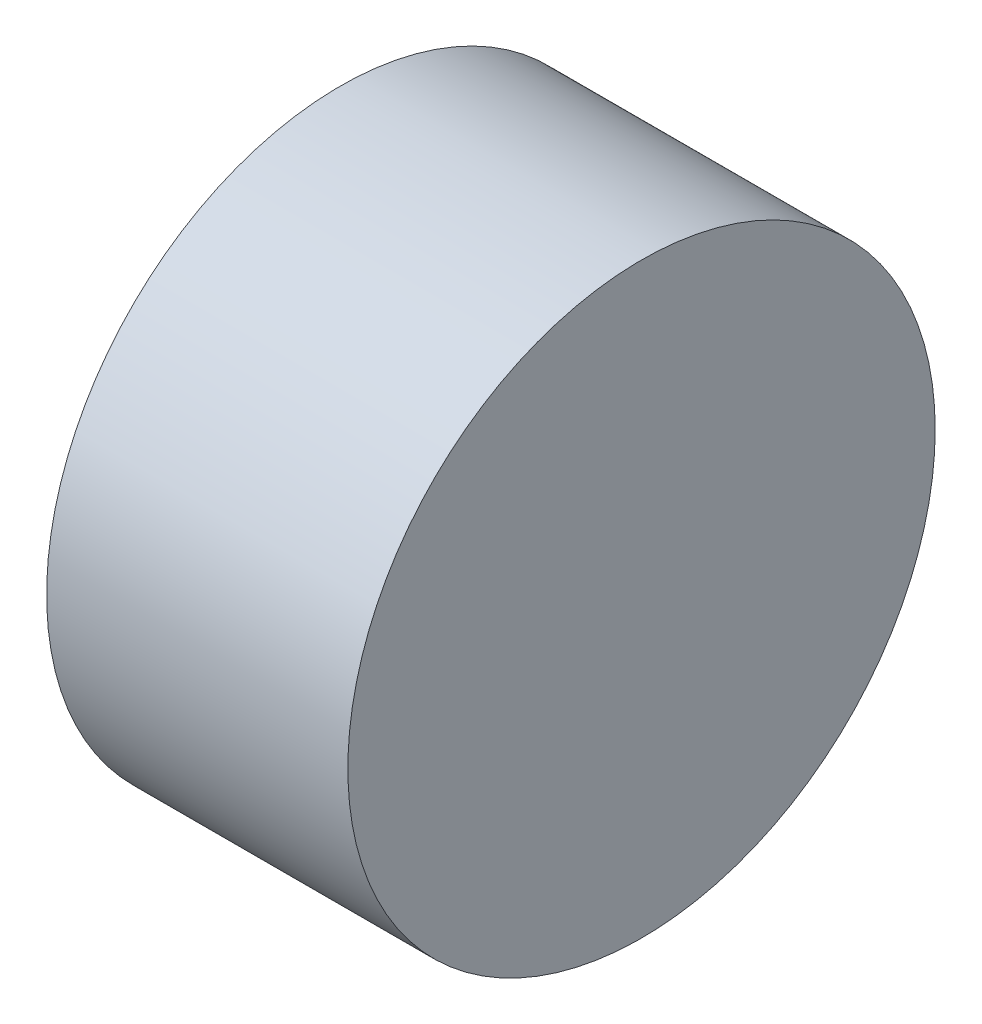
ISO-10303-21;
HEADER;
FILE_DESCRIPTION(('STEP AP214'),'2;1');
FILE_NAME('part.step','',(''),(''),'','','');
FILE_SCHEMA(('AUTOMOTIVE_DESIGN { 1 0 10303 214 1 1 1 1 }'));
ENDSEC;
DATA;
#1=APPLICATION_CONTEXT('core data for automotive mechanical design processes');
#2=APPLICATION_PROTOCOL_DEFINITION('international standard','automotive_design',2000,#1);
#3=PRODUCT_CONTEXT('',#1,'mechanical');
#4=PRODUCT('Part','Part','',(#3));
#5=PRODUCT_RELATED_PRODUCT_CATEGORY('part','',(#4));
#6=PRODUCT_DEFINITION_FORMATION('','',#4);
#7=PRODUCT_DEFINITION_CONTEXT('part definition',#1,'design');
#8=PRODUCT_DEFINITION('design','',#6,#7);
#9=PRODUCT_DEFINITION_SHAPE('','',#8);
#10=(LENGTH_UNIT() NAMED_UNIT(*) SI_UNIT(.MILLI.,.METRE.));
#11=(NAMED_UNIT(*) PLANE_ANGLE_UNIT() SI_UNIT($,.RADIAN.));
#12=(NAMED_UNIT(*) SI_UNIT($,.STERADIAN.) SOLID_ANGLE_UNIT());
#13=UNCERTAINTY_MEASURE_WITH_UNIT(LENGTH_MEASURE(1.E-05),#10,'distance_accuracy_value','');
#14=(GEOMETRIC_REPRESENTATION_CONTEXT(3) GLOBAL_UNCERTAINTY_ASSIGNED_CONTEXT((#13)) GLOBAL_UNIT_ASSIGNED_CONTEXT((#10,
#11,#12)) REPRESENTATION_CONTEXT('',''));
#15=CARTESIAN_POINT('',(0.,0.,0.));
#16=DIRECTION('',(0.,0.,1.));
#17=DIRECTION('',(1.,0.,0.));
#18=AXIS2_PLACEMENT_3D('',#15,#16,#17);
#19=CARTESIAN_POINT('',(8.,0.,0.));
#20=DIRECTION('',(-1.,0.,0.));
#21=DIRECTION('',(0.,0.,1.));
#22=AXIS2_PLACEMENT_3D('',#19,#20,#21);
#23=CYLINDRICAL_SURFACE('',#22,7.8);
#24=CARTESIAN_POINT('',(8.,0.,0.));
#25=DIRECTION('',(1.,0.,0.));
#26=DIRECTION('',(0.,0.,-1.));
#27=AXIS2_PLACEMENT_3D('',#24,#25,#26);
#28=CIRCLE('',#27,7.8);
#29=CARTESIAN_POINT('',(8.,0.,-7.8));
#30=VERTEX_POINT('',#29);
#31=EDGE_CURVE('E10',#30,#30,#28,.T.);
#32=ORIENTED_EDGE('',*,*,#31,.F.);
#33=EDGE_LOOP('',(#32));
#34=FACE_BOUND('',#33,.T.);
#35=CARTESIAN_POINT('',(0.,0.,0.));
#36=DIRECTION('',(1.,0.,0.));
#37=DIRECTION('',(0.,0.,-1.));
#38=AXIS2_PLACEMENT_3D('',#35,#36,#37);
#39=CIRCLE('',#38,7.8);
#40=CARTESIAN_POINT('',(0.,0.,-7.8));
#41=VERTEX_POINT('',#40);
#42=EDGE_CURVE('E36',#41,#41,#39,.T.);
#43=ORIENTED_EDGE('',*,*,#42,.T.);
#44=EDGE_LOOP('',(#43));
#45=FACE_BOUND('',#44,.T.);
#46=ADVANCED_FACE('F33',(#34,#45),#23,.T.);
#47=CARTESIAN_POINT('',(8.,0.,0.));
#48=DIRECTION('',(1.,0.,0.));
#49=DIRECTION('',(0.,0.,-1.));
#50=AXIS2_PLACEMENT_3D('',#47,#48,#49);
#51=PLANE('',#50);
#52=ORIENTED_EDGE('',*,*,#31,.T.);
#53=EDGE_LOOP('',(#52));
#54=FACE_BOUND('',#53,.T.);
#55=ADVANCED_FACE('F62',(#54),#51,.T.);
#56=CARTESIAN_POINT('',(0.,0.,0.));
#57=DIRECTION('',(1.,0.,0.));
#58=DIRECTION('',(0.,0.,-1.));
#59=AXIS2_PLACEMENT_3D('',#56,#57,#58);
#60=PLANE('',#59);
#61=CARTESIAN_POINT('',(0.,0.,0.));
#62=DIRECTION('',(-1.,0.,0.));
#63=DIRECTION('',(0.,0.,1.));
#64=AXIS2_PLACEMENT_3D('',#61,#62,#63);
#65=CIRCLE('',#64,1.5);
#66=CARTESIAN_POINT('',(0.,0.,1.5));
#67=VERTEX_POINT('',#66);
#68=EDGE_CURVE('E45',#67,#67,#65,.T.);
#69=ORIENTED_EDGE('',*,*,#68,.F.);
#70=EDGE_LOOP('',(#69));
#71=FACE_BOUND('',#70,.T.);
#72=ORIENTED_EDGE('',*,*,#42,.F.);
#73=EDGE_LOOP('',(#72));
#74=FACE_BOUND('',#73,.T.);
#75=ADVANCED_FACE('F56',(#71,#74),#60,.F.);
#76=CARTESIAN_POINT('',(1.,0.,0.));
#77=DIRECTION('',(-1.,0.,0.));
#78=DIRECTION('',(0.,0.,1.));
#79=AXIS2_PLACEMENT_3D('',#76,#77,#78);
#80=CYLINDRICAL_SURFACE('',#79,1.5);
#81=CARTESIAN_POINT('',(1.,0.,0.));
#82=DIRECTION('',(-1.,0.,0.));
#83=DIRECTION('',(0.,0.,1.));
#84=AXIS2_PLACEMENT_3D('',#81,#82,#83);
#85=CIRCLE('',#84,1.5);
#86=CARTESIAN_POINT('',(1.,0.,1.5));
#87=VERTEX_POINT('',#86);
#88=EDGE_CURVE('E43',#87,#87,#85,.T.);
#89=ORIENTED_EDGE('',*,*,#88,.F.);
#90=EDGE_LOOP('',(#89));
#91=FACE_BOUND('',#90,.T.);
#92=ORIENTED_EDGE('',*,*,#68,.T.);
#93=EDGE_LOOP('',(#92));
#94=FACE_BOUND('',#93,.T.);
#95=ADVANCED_FACE('F53',(#91,#94),#80,.F.);
#96=CARTESIAN_POINT('',(1.,0.,0.));
#97=DIRECTION('',(-1.,0.,0.));
#98=DIRECTION('',(0.,0.,1.));
#99=AXIS2_PLACEMENT_3D('',#96,#97,#98);
#100=PLANE('',#99);
#101=ORIENTED_EDGE('',*,*,#88,.T.);
#102=EDGE_LOOP('',(#101));
#103=FACE_BOUND('',#102,.T.);
#104=ADVANCED_FACE('F51',(#103),#100,.T.);
#105=CLOSED_SHELL('',(#46,#55,#75,#95,#104));
#106=MANIFOLD_SOLID_BREP('B2',#105);
#107=ADVANCED_BREP_SHAPE_REPRESENTATION('',(#18,#106),#14);
#108=SHAPE_DEFINITION_REPRESENTATION(#9,#107);
ENDSEC;
END-ISO-10303-21;
